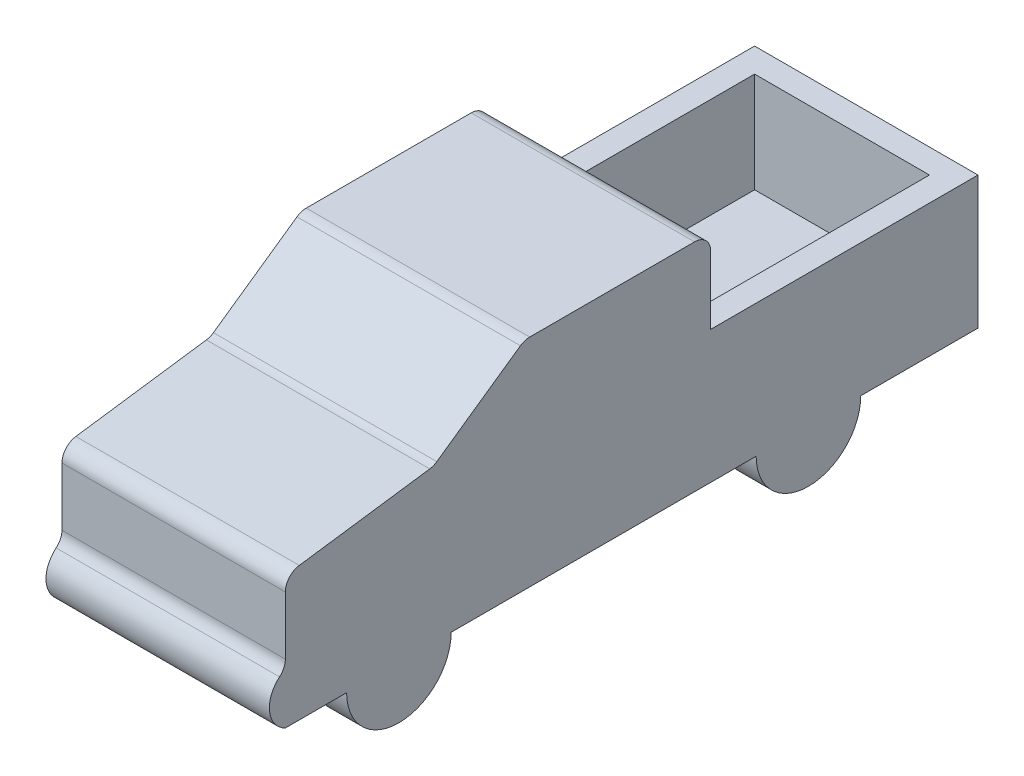
ISO-10303-21;
HEADER;
FILE_DESCRIPTION(('STEP AP214'),'2;1');
FILE_NAME('part.step','',(''),(''),'','','');
FILE_SCHEMA(('AUTOMOTIVE_DESIGN { 1 0 10303 214 1 1 1 1 }'));
ENDSEC;
DATA;
#1=APPLICATION_CONTEXT('core data for automotive mechanical design processes');
#2=APPLICATION_PROTOCOL_DEFINITION('international standard','automotive_design',2000,#1);
#3=PRODUCT_CONTEXT('',#1,'mechanical');
#4=PRODUCT('Part','Part','',(#3));
#5=PRODUCT_RELATED_PRODUCT_CATEGORY('part','',(#4));
#6=PRODUCT_DEFINITION_FORMATION('','',#4);
#7=PRODUCT_DEFINITION_CONTEXT('part definition',#1,'design');
#8=PRODUCT_DEFINITION('design','',#6,#7);
#9=PRODUCT_DEFINITION_SHAPE('','',#8);
#10=(LENGTH_UNIT() NAMED_UNIT(*) SI_UNIT(.MILLI.,.METRE.));
#11=(NAMED_UNIT(*) PLANE_ANGLE_UNIT() SI_UNIT($,.RADIAN.));
#12=(NAMED_UNIT(*) SI_UNIT($,.STERADIAN.) SOLID_ANGLE_UNIT());
#13=UNCERTAINTY_MEASURE_WITH_UNIT(LENGTH_MEASURE(1.E-05),#10,'distance_accuracy_value','');
#14=(GEOMETRIC_REPRESENTATION_CONTEXT(3) GLOBAL_UNCERTAINTY_ASSIGNED_CONTEXT((#13)) GLOBAL_UNIT_ASSIGNED_CONTEXT((#10,
#11,#12)) REPRESENTATION_CONTEXT('',''));
#15=CARTESIAN_POINT('',(0.,0.,0.));
#16=DIRECTION('',(0.,0.,1.));
#17=DIRECTION('',(1.,0.,0.));
#18=AXIS2_PLACEMENT_3D('',#15,#16,#17);
#19=CARTESIAN_POINT('',(69.,0.,0.));
#20=DIRECTION('',(0.,1.,0.));
#21=DIRECTION('',(0.,0.,1.));
#22=AXIS2_PLACEMENT_3D('',#19,#20,#21);
#23=PLANE('',#22);
#24=DIRECTION('',(-1.,0.,0.));
#25=VECTOR('',#24,1.);
#26=CARTESIAN_POINT('',(-48.6,0.,-92.6559396248703));
#27=LINE('',#26,#25);
#28=CARTESIAN_POINT('',(-48.6,0.,-92.6559396248703));
#29=VERTEX_POINT('',#28);
#30=CARTESIAN_POINT('',(-69.,0.,-92.6559396248703));
#31=VERTEX_POINT('',#30);
#32=EDGE_CURVE('E228',#29,#31,#27,.T.);
#33=ORIENTED_EDGE('',*,*,#32,.T.);
#34=DIRECTION('',(0.,0.,-1.));
#35=VECTOR('',#34,1.);
#36=CARTESIAN_POINT('',(-69.,0.,0.));
#37=LINE('',#36,#35);
#38=CARTESIAN_POINT('',(-69.,0.,-165.1));
#39=VERTEX_POINT('',#38);
#40=EDGE_CURVE('E211',#31,#39,#37,.T.);
#41=ORIENTED_EDGE('',*,*,#40,.T.);
#42=DIRECTION('',(-1.,0.,0.));
#43=VECTOR('',#42,1.);
#44=CARTESIAN_POINT('',(69.,0.,-165.1));
#45=LINE('',#44,#43);
#46=CARTESIAN_POINT('',(69.,0.,-165.1));
#47=VERTEX_POINT('',#46);
#48=EDGE_CURVE('E415',#47,#39,#45,.T.);
#49=ORIENTED_EDGE('',*,*,#48,.F.);
#50=DIRECTION('',(0.,0.,-1.));
#51=VECTOR('',#50,1.);
#52=CARTESIAN_POINT('',(69.,0.,262.79362659682));
#53=LINE('',#52,#51);
#54=CARTESIAN_POINT('',(69.,0.,-92.6559396248703));
#55=VERTEX_POINT('',#54);
#56=EDGE_CURVE('E343',#55,#47,#53,.T.);
#57=ORIENTED_EDGE('',*,*,#56,.F.);
#58=DIRECTION('',(1.,0.,0.));
#59=VECTOR('',#58,1.);
#60=CARTESIAN_POINT('',(48.6,0.,-92.6559396248703));
#61=LINE('',#60,#59);
#62=CARTESIAN_POINT('',(48.6,0.,-92.6559396248703));
#63=VERTEX_POINT('',#62);
#64=EDGE_CURVE('E277',#63,#55,#61,.T.);
#65=ORIENTED_EDGE('',*,*,#64,.F.);
#66=DIRECTION('',(0.,0.,1.));
#67=VECTOR('',#66,1.);
#68=CARTESIAN_POINT('',(48.6,0.,-28.0559396248703));
#69=LINE('',#68,#67);
#70=CARTESIAN_POINT('',(48.6,0.,-28.0559396248703));
#71=VERTEX_POINT('',#70);
#72=EDGE_CURVE('E273',#63,#71,#69,.T.);
#73=ORIENTED_EDGE('',*,*,#72,.T.);
#74=DIRECTION('',(1.,0.,0.));
#75=VECTOR('',#74,1.);
#76=CARTESIAN_POINT('',(48.6,0.,-28.0559396248703));
#77=LINE('',#76,#75);
#78=CARTESIAN_POINT('',(69.,0.,-28.0559396248703));
#79=VERTEX_POINT('',#78);
#80=EDGE_CURVE('E280',#71,#79,#77,.T.);
#81=ORIENTED_EDGE('',*,*,#80,.T.);
#82=CARTESIAN_POINT('',(69.,0.,160.34406037513));
#83=VERTEX_POINT('',#82);
#84=EDGE_CURVE('E350',#83,#79,#53,.T.);
#85=ORIENTED_EDGE('',*,*,#84,.F.);
#86=DIRECTION('',(1.,0.,0.));
#87=VECTOR('',#86,1.);
#88=CARTESIAN_POINT('',(48.6,0.,160.34406037513));
#89=LINE('',#88,#87);
#90=CARTESIAN_POINT('',(48.6,0.,160.34406037513));
#91=VERTEX_POINT('',#90);
#92=EDGE_CURVE('E295',#91,#83,#89,.T.);
#93=ORIENTED_EDGE('',*,*,#92,.F.);
#94=DIRECTION('',(0.,0.,1.));
#95=VECTOR('',#94,1.);
#96=CARTESIAN_POINT('',(48.6,0.,224.94406037513));
#97=LINE('',#96,#95);
#98=CARTESIAN_POINT('',(48.6,0.,224.94406037513));
#99=VERTEX_POINT('',#98);
#100=EDGE_CURVE('E291',#91,#99,#97,.T.);
#101=ORIENTED_EDGE('',*,*,#100,.T.);
#102=DIRECTION('',(1.,0.,0.));
#103=VECTOR('',#102,1.);
#104=CARTESIAN_POINT('',(48.6,0.,224.94406037513));
#105=LINE('',#104,#103);
#106=CARTESIAN_POINT('',(69.,0.,224.94406037513));
#107=VERTEX_POINT('',#106);
#108=EDGE_CURVE('E298',#99,#107,#105,.T.);
#109=ORIENTED_EDGE('',*,*,#108,.T.);
#110=CARTESIAN_POINT('',(69.,0.,262.79362659682));
#111=VERTEX_POINT('',#110);
#112=EDGE_CURVE('E345',#111,#107,#53,.T.);
#113=ORIENTED_EDGE('',*,*,#112,.F.);
#114=DIRECTION('',(-1.,0.,0.));
#115=VECTOR('',#114,1.);
#116=CARTESIAN_POINT('',(69.,0.,262.79362659682));
#117=LINE('',#116,#115);
#118=CARTESIAN_POINT('',(-69.,0.,262.79362659682));
#119=VERTEX_POINT('',#118);
#120=EDGE_CURVE('E418',#111,#119,#117,.T.);
#121=ORIENTED_EDGE('',*,*,#120,.T.);
#122=CARTESIAN_POINT('',(-69.,0.,224.94406037513));
#123=VERTEX_POINT('',#122);
#124=EDGE_CURVE('E226',#119,#123,#37,.T.);
#125=ORIENTED_EDGE('',*,*,#124,.T.);
#126=DIRECTION('',(-1.,0.,0.));
#127=VECTOR('',#126,1.);
#128=CARTESIAN_POINT('',(-48.6,0.,224.94406037513));
#129=LINE('',#128,#127);
#130=CARTESIAN_POINT('',(-48.6,0.,224.94406037513));
#131=VERTEX_POINT('',#130);
#132=EDGE_CURVE('E258',#131,#123,#129,.T.);
#133=ORIENTED_EDGE('',*,*,#132,.F.);
#134=DIRECTION('',(0.,0.,1.));
#135=VECTOR('',#134,1.);
#136=CARTESIAN_POINT('',(-48.6,0.,224.94406037513));
#137=LINE('',#136,#135);
#138=CARTESIAN_POINT('',(-48.6,0.,160.34406037513));
#139=VERTEX_POINT('',#138);
#140=EDGE_CURVE('E254',#139,#131,#137,.T.);
#141=ORIENTED_EDGE('',*,*,#140,.F.);
#142=DIRECTION('',(-1.,0.,0.));
#143=VECTOR('',#142,1.);
#144=CARTESIAN_POINT('',(-48.6,0.,160.34406037513));
#145=LINE('',#144,#143);
#146=CARTESIAN_POINT('',(-69.,0.,160.34406037513));
#147=VERTEX_POINT('',#146);
#148=EDGE_CURVE('E262',#139,#147,#145,.T.);
#149=ORIENTED_EDGE('',*,*,#148,.T.);
#150=CARTESIAN_POINT('',(-69.,0.,-28.0559396248702));
#151=VERTEX_POINT('',#150);
#152=EDGE_CURVE('E223',#147,#151,#37,.T.);
#153=ORIENTED_EDGE('',*,*,#152,.T.);
#154=DIRECTION('',(-1.,0.,0.));
#155=VECTOR('',#154,1.);
#156=CARTESIAN_POINT('',(-48.6,0.,-28.0559396248703));
#157=LINE('',#156,#155);
#158=CARTESIAN_POINT('',(-48.6,0.,-28.0559396248703));
#159=VERTEX_POINT('',#158);
#160=EDGE_CURVE('E236',#159,#151,#157,.T.);
#161=ORIENTED_EDGE('',*,*,#160,.F.);
#162=DIRECTION('',(0.,0.,1.));
#163=VECTOR('',#162,1.);
#164=CARTESIAN_POINT('',(-48.6,0.,-28.0559396248703));
#165=LINE('',#164,#163);
#166=EDGE_CURVE('E230',#29,#159,#165,.T.);
#167=ORIENTED_EDGE('',*,*,#166,.F.);
#168=EDGE_LOOP('',(#33,#41,#49,#57,#65,#73,#81,#85,#93,#101,#109,#113,#121,#125,#133,#141,#149,
#153,#161,#167));
#169=FACE_BOUND('',#168,.T.);
#170=ADVANCED_FACE('F37',(#169),#23,.F.);
#171=CARTESIAN_POINT('',(69.,81.9,-150.1));
#172=DIRECTION('',(0.,0.,-1.));
#173=DIRECTION('',(-1.,0.,0.));
#174=AXIS2_PLACEMENT_3D('',#171,#172,#173);
#175=PLANE('',#174);
#176=DIRECTION('',(-1.,0.,0.));
#177=VECTOR('',#176,1.);
#178=CARTESIAN_POINT('',(69.,81.9,-150.1));
#179=LINE('',#178,#177);
#180=CARTESIAN_POINT('',(54.,81.9,-150.1));
#181=VERTEX_POINT('',#180);
#182=CARTESIAN_POINT('',(-54.,81.9,-150.1));
#183=VERTEX_POINT('',#182);
#184=EDGE_CURVE('E408',#181,#183,#179,.T.);
#185=ORIENTED_EDGE('',*,*,#184,.T.);
#186=DIRECTION('',(0.,-1.,0.));
#187=VECTOR('',#186,1.);
#188=CARTESIAN_POINT('',(-54.,232.747638364013,-150.1));
#189=LINE('',#188,#187);
#190=CARTESIAN_POINT('',(-54.,20.,-150.1));
#191=VERTEX_POINT('',#190);
#192=EDGE_CURVE('E318',#183,#191,#189,.T.);
#193=ORIENTED_EDGE('',*,*,#192,.T.);
#194=DIRECTION('',(-1.,0.,0.));
#195=VECTOR('',#194,1.);
#196=CARTESIAN_POINT('',(69.,20.,-150.1));
#197=LINE('',#196,#195);
#198=CARTESIAN_POINT('',(54.,20.,-150.1));
#199=VERTEX_POINT('',#198);
#200=EDGE_CURVE('E404',#199,#191,#197,.T.);
#201=ORIENTED_EDGE('',*,*,#200,.F.);
#202=DIRECTION('',(0.,-1.,0.));
#203=VECTOR('',#202,1.);
#204=CARTESIAN_POINT('',(54.,232.747638364013,-150.1));
#205=LINE('',#204,#203);
#206=EDGE_CURVE('E334',#181,#199,#205,.T.);
#207=ORIENTED_EDGE('',*,*,#206,.F.);
#208=EDGE_LOOP('',(#185,#193,#201,#207));
#209=FACE_BOUND('',#208,.T.);
#210=ADVANCED_FACE('F558',(#209),#175,.F.);
#211=CARTESIAN_POINT('',(69.,20.,-150.1));
#212=DIRECTION('',(0.,-1.,0.));
#213=DIRECTION('',(0.,0.,-1.));
#214=AXIS2_PLACEMENT_3D('',#211,#212,#213);
#215=PLANE('',#214);
#216=ORIENTED_EDGE('',*,*,#200,.T.);
#217=DIRECTION('',(0.,0.,1.));
#218=VECTOR('',#217,1.);
#219=CARTESIAN_POINT('',(-54.,20.,0.));
#220=LINE('',#219,#218);
#221=CARTESIAN_POINT('',(-54.,20.,0.));
#222=VERTEX_POINT('',#221);
#223=EDGE_CURVE('E302',#191,#222,#220,.T.);
#224=ORIENTED_EDGE('',*,*,#223,.T.);
#225=DIRECTION('',(-1.,0.,0.));
#226=VECTOR('',#225,1.);
#227=CARTESIAN_POINT('',(69.,20.,0.));
#228=LINE('',#227,#226);
#229=CARTESIAN_POINT('',(54.,20.,0.));
#230=VERTEX_POINT('',#229);
#231=EDGE_CURVE('E374',#230,#222,#228,.T.);
#232=ORIENTED_EDGE('',*,*,#231,.F.);
#233=DIRECTION('',(0.,0.,1.));
#234=VECTOR('',#233,1.);
#235=CARTESIAN_POINT('',(54.,20.,0.));
#236=LINE('',#235,#234);
#237=EDGE_CURVE('E315',#199,#230,#236,.T.);
#238=ORIENTED_EDGE('',*,*,#237,.F.);
#239=EDGE_LOOP('',(#216,#224,#232,#238));
#240=FACE_BOUND('',#239,.T.);
#241=ADVANCED_FACE('F563',(#240),#215,.F.);
#242=CARTESIAN_POINT('',(69.,20.,0.));
#243=DIRECTION('',(0.,0.,1.));
#244=DIRECTION('',(1.,0.,0.));
#245=AXIS2_PLACEMENT_3D('',#242,#243,#244);
#246=PLANE('',#245);
#247=DIRECTION('',(0.,1.,0.));
#248=VECTOR('',#247,1.);
#249=CARTESIAN_POINT('',(-69.,20.,0.));
#250=LINE('',#249,#248);
#251=CARTESIAN_POINT('',(-69.,81.8999999999999,0.));
#252=VERTEX_POINT('',#251);
#253=CARTESIAN_POINT('',(-69.,123.7,0.));
#254=VERTEX_POINT('',#253);
#255=EDGE_CURVE('E383',#252,#254,#250,.T.);
#256=ORIENTED_EDGE('',*,*,#255,.T.);
#257=DIRECTION('',(-1.,0.,0.));
#258=VECTOR('',#257,1.);
#259=CARTESIAN_POINT('',(69.,123.7,0.));
#260=LINE('',#259,#258);
#261=CARTESIAN_POINT('',(69.,123.7,0.));
#262=VERTEX_POINT('',#261);
#263=EDGE_CURVE('E449',#254,#262,#260,.F.);
#264=ORIENTED_EDGE('',*,*,#263,.T.);
#265=DIRECTION('',(0.,1.,0.));
#266=VECTOR('',#265,1.);
#267=CARTESIAN_POINT('',(69.,20.,0.));
#268=LINE('',#267,#266);
#269=CARTESIAN_POINT('',(69.,81.8999999999998,0.));
#270=VERTEX_POINT('',#269);
#271=EDGE_CURVE('E356',#270,#262,#268,.T.);
#272=ORIENTED_EDGE('',*,*,#271,.F.);
#273=DIRECTION('',(-1.,0.,0.));
#274=VECTOR('',#273,1.);
#275=CARTESIAN_POINT('',(69.,81.8999999999998,0.));
#276=LINE('',#275,#274);
#277=CARTESIAN_POINT('',(54.,81.8999999999999,0.));
#278=VERTEX_POINT('',#277);
#279=EDGE_CURVE('E327',#270,#278,#276,.T.);
#280=ORIENTED_EDGE('',*,*,#279,.T.);
#281=DIRECTION('',(0.,-1.,0.));
#282=VECTOR('',#281,1.);
#283=CARTESIAN_POINT('',(54.,232.747638364013,0.));
#284=LINE('',#283,#282);
#285=EDGE_CURVE('E330',#278,#230,#284,.T.);
#286=ORIENTED_EDGE('',*,*,#285,.T.);
#287=ORIENTED_EDGE('',*,*,#231,.T.);
#288=DIRECTION('',(0.,-1.,0.));
#289=VECTOR('',#288,1.);
#290=CARTESIAN_POINT('',(-54.,232.747638364013,0.));
#291=LINE('',#290,#289);
#292=CARTESIAN_POINT('',(-54.,81.8999999999998,0.));
#293=VERTEX_POINT('',#292);
#294=EDGE_CURVE('E311',#293,#222,#291,.T.);
#295=ORIENTED_EDGE('',*,*,#294,.F.);
#296=DIRECTION('',(1.,0.,0.));
#297=VECTOR('',#296,1.);
#298=CARTESIAN_POINT('',(-69.,81.8999999999998,0.));
#299=LINE('',#298,#297);
#300=EDGE_CURVE('E310',#252,#293,#299,.T.);
#301=ORIENTED_EDGE('',*,*,#300,.F.);
#302=EDGE_LOOP('',(#256,#264,#272,#280,#286,#287,#295,#301));
#303=FACE_BOUND('',#302,.T.);
#304=ADVANCED_FACE('F571',(#303),#246,.F.);
#305=CARTESIAN_POINT('',(69.,15.7395723137565,255.14406037513));
#306=DIRECTION('',(-1.,0.,0.));
#307=DIRECTION('',(0.,0.,1.));
#308=AXIS2_PLACEMENT_3D('',#305,#306,#307);
#309=CYLINDRICAL_SURFACE('',#308,17.5);
#310=CARTESIAN_POINT('',(69.,15.7395723137565,255.14406037513));
#311=DIRECTION('',(1.,0.,0.));
#312=DIRECTION('',(0.,0.,-1.));
#313=AXIS2_PLACEMENT_3D('',#310,#311,#312);
#314=CIRCLE('',#313,17.5);
#315=CARTESIAN_POINT('',(69.,29.1597981364929,266.375602516206));
#316=VERTEX_POINT('',#315);
#317=EDGE_CURVE('E340',#316,#111,#314,.T.);
#318=ORIENTED_EDGE('',*,*,#317,.F.);
#319=DIRECTION('',(-1.,0.,0.));
#320=VECTOR('',#319,1.);
#321=CARTESIAN_POINT('',(69.,29.1597981364929,266.375602516206));
#322=LINE('',#321,#320);
#323=CARTESIAN_POINT('',(-69.,29.1597981364929,266.375602516206));
#324=VERTEX_POINT('',#323);
#325=EDGE_CURVE('E422',#316,#324,#322,.T.);
#326=ORIENTED_EDGE('',*,*,#325,.T.);
#327=CARTESIAN_POINT('',(-69.,15.7395723137565,255.14406037513));
#328=DIRECTION('',(1.,0.,0.));
#329=DIRECTION('',(0.,0.,-1.));
#330=AXIS2_PLACEMENT_3D('',#327,#328,#329);
#331=CIRCLE('',#330,17.5);
#332=EDGE_CURVE('E224',#324,#119,#331,.T.);
#333=ORIENTED_EDGE('',*,*,#332,.T.);
#334=ORIENTED_EDGE('',*,*,#120,.F.);
#335=EDGE_LOOP('',(#318,#326,#333,#334));
#336=FACE_BOUND('',#335,.T.);
#337=ADVANCED_FACE('F509',(#336),#309,.T.);
#338=CARTESIAN_POINT('',(69.,0.,-165.1));
#339=DIRECTION('',(0.,0.,1.));
#340=DIRECTION('',(1.,0.,0.));
#341=AXIS2_PLACEMENT_3D('',#338,#339,#340);
#342=PLANE('',#341);
#343=DIRECTION('',(0.,1.,0.));
#344=VECTOR('',#343,1.);
#345=CARTESIAN_POINT('',(-69.,0.,-165.1));
#346=LINE('',#345,#344);
#347=CARTESIAN_POINT('',(-69.,81.9,-165.1));
#348=VERTEX_POINT('',#347);
#349=EDGE_CURVE('E218',#39,#348,#346,.T.);
#350=ORIENTED_EDGE('',*,*,#349,.T.);
#351=DIRECTION('',(-1.,0.,0.));
#352=VECTOR('',#351,1.);
#353=CARTESIAN_POINT('',(69.,81.9,-165.1));
#354=LINE('',#353,#352);
#355=CARTESIAN_POINT('',(69.,81.9,-165.1));
#356=VERTEX_POINT('',#355);
#357=EDGE_CURVE('E411',#356,#348,#354,.T.);
#358=ORIENTED_EDGE('',*,*,#357,.F.);
#359=DIRECTION('',(0.,1.,0.));
#360=VECTOR('',#359,1.);
#361=CARTESIAN_POINT('',(69.,0.,-165.1));
#362=LINE('',#361,#360);
#363=EDGE_CURVE('E349',#47,#356,#362,.T.);
#364=ORIENTED_EDGE('',*,*,#363,.F.);
#365=ORIENTED_EDGE('',*,*,#48,.T.);
#366=EDGE_LOOP('',(#350,#358,#364,#365));
#367=FACE_BOUND('',#366,.T.);
#368=ADVANCED_FACE('F530',(#367),#342,.F.);
#369=CARTESIAN_POINT('',(69.,81.9,-165.1));
#370=DIRECTION('',(0.,-1.,0.));
#371=DIRECTION('',(0.,0.,-1.));
#372=AXIS2_PLACEMENT_3D('',#369,#370,#371);
#373=PLANE('',#372);
#374=DIRECTION('',(0.,0.,1.));
#375=VECTOR('',#374,1.);
#376=CARTESIAN_POINT('',(-69.,81.9,-165.1));
#377=LINE('',#376,#375);
#378=EDGE_CURVE('E380',#348,#252,#377,.T.);
#379=ORIENTED_EDGE('',*,*,#378,.T.);
#380=ORIENTED_EDGE('',*,*,#300,.T.);
#381=DIRECTION('',(0.,0.,-1.));
#382=VECTOR('',#381,1.);
#383=CARTESIAN_POINT('',(-54.,81.8999999999998,-1.1346331053111E-13));
#384=LINE('',#383,#382);
#385=EDGE_CURVE('E306',#293,#183,#384,.T.);
#386=ORIENTED_EDGE('',*,*,#385,.T.);
#387=ORIENTED_EDGE('',*,*,#184,.F.);
#388=DIRECTION('',(0.,0.,-1.));
#389=VECTOR('',#388,1.);
#390=CARTESIAN_POINT('',(54.,81.8999999999998,-1.1346331053111E-13));
#391=LINE('',#390,#389);
#392=EDGE_CURVE('E324',#278,#181,#391,.T.);
#393=ORIENTED_EDGE('',*,*,#392,.F.);
#394=ORIENTED_EDGE('',*,*,#279,.F.);
#395=DIRECTION('',(0.,0.,1.));
#396=VECTOR('',#395,1.);
#397=CARTESIAN_POINT('',(69.,81.9,-165.1));
#398=LINE('',#397,#396);
#399=EDGE_CURVE('E353',#356,#270,#398,.T.);
#400=ORIENTED_EDGE('',*,*,#399,.F.);
#401=ORIENTED_EDGE('',*,*,#357,.T.);
#402=EDGE_LOOP('',(#379,#380,#386,#387,#393,#394,#400,#401));
#403=FACE_BOUND('',#402,.T.);
#404=ADVANCED_FACE('F534',(#403),#373,.F.);
#405=CARTESIAN_POINT('',(69.,133.7,0.));
#406=DIRECTION('',(0.,-1.,0.));
#407=DIRECTION('',(0.,0.,-1.));
#408=AXIS2_PLACEMENT_3D('',#405,#406,#407);
#409=PLANE('',#408);
#410=DIRECTION('',(0.,0.,1.));
#411=VECTOR('',#410,1.);
#412=CARTESIAN_POINT('',(69.,133.7,0.));
#413=LINE('',#412,#411);
#414=CARTESIAN_POINT('',(69.,133.7,10.));
#415=VERTEX_POINT('',#414);
#416=CARTESIAN_POINT('',(69.,133.7,111.84701211121));
#417=VERTEX_POINT('',#416);
#418=EDGE_CURVE('E360',#415,#417,#413,.T.);
#419=ORIENTED_EDGE('',*,*,#418,.F.);
#420=DIRECTION('',(-1.,0.,0.));
#421=VECTOR('',#420,1.);
#422=CARTESIAN_POINT('',(69.,133.7,10.));
#423=LINE('',#422,#421);
#424=CARTESIAN_POINT('',(-69.,133.7,10.));
#425=VERTEX_POINT('',#424);
#426=EDGE_CURVE('E436',#415,#425,#423,.T.);
#427=ORIENTED_EDGE('',*,*,#426,.T.);
#428=DIRECTION('',(0.,0.,1.));
#429=VECTOR('',#428,1.);
#430=CARTESIAN_POINT('',(-69.,133.7,0.));
#431=LINE('',#430,#429);
#432=CARTESIAN_POINT('',(-69.,133.7,111.84701211121));
#433=VERTEX_POINT('',#432);
#434=EDGE_CURVE('E387',#425,#433,#431,.T.);
#435=ORIENTED_EDGE('',*,*,#434,.T.);
#436=DIRECTION('',(-1.,0.,0.));
#437=VECTOR('',#436,1.);
#438=CARTESIAN_POINT('',(69.,133.7,111.84701211121));
#439=LINE('',#438,#437);
#440=EDGE_CURVE('E433',#433,#417,#439,.F.);
#441=ORIENTED_EDGE('',*,*,#440,.T.);
#442=EDGE_LOOP('',(#419,#427,#435,#441));
#443=FACE_BOUND('',#442,.T.);
#444=ADVANCED_FACE('F544',(#443),#409,.F.);
#445=CARTESIAN_POINT('',(69.,133.7,115.));
#446=DIRECTION('',(0.,-0.819152044288995,-0.573576436351042));
#447=DIRECTION('',(0.,0.573576436351042,-0.819152044288995));
#448=AXIS2_PLACEMENT_3D('',#445,#446,#447);
#449=PLANE('',#448);
#450=DIRECTION('',(0.,-0.573576436351042,0.819152044288994));
#451=VECTOR('',#450,1.);
#452=CARTESIAN_POINT('',(69.,133.7,115.));
#453=LINE('',#452,#451);
#454=CARTESIAN_POINT('',(69.,131.89152044289,117.582776474721));
#455=VERTEX_POINT('',#454);
#456=CARTESIAN_POINT('',(69.,95.7296916570861,169.227220175317));
#457=VERTEX_POINT('',#456);
#458=EDGE_CURVE('E364',#455,#457,#453,.T.);
#459=ORIENTED_EDGE('',*,*,#458,.F.);
#460=DIRECTION('',(-1.,0.,0.));
#461=VECTOR('',#460,1.);
#462=CARTESIAN_POINT('',(69.,131.89152044289,117.582776474721));
#463=LINE('',#462,#461);
#464=CARTESIAN_POINT('',(-69.,131.89152044289,117.582776474721));
#465=VERTEX_POINT('',#464);
#466=EDGE_CURVE('E464',#455,#465,#463,.T.);
#467=ORIENTED_EDGE('',*,*,#466,.T.);
#468=DIRECTION('',(0.,-0.573576436351042,0.819152044288994));
#469=VECTOR('',#468,1.);
#470=CARTESIAN_POINT('',(-69.,133.7,115.));
#471=LINE('',#470,#469);
#472=CARTESIAN_POINT('',(-69.,95.7296916570861,169.227220175317));
#473=VERTEX_POINT('',#472);
#474=EDGE_CURVE('E391',#465,#473,#471,.T.);
#475=ORIENTED_EDGE('',*,*,#474,.T.);
#476=DIRECTION('',(-1.,0.,0.));
#477=VECTOR('',#476,1.);
#478=CARTESIAN_POINT('',(69.,95.7296916570861,169.227220175317));
#479=LINE('',#478,#477);
#480=EDGE_CURVE('E461',#473,#457,#479,.F.);
#481=ORIENTED_EDGE('',*,*,#480,.T.);
#482=EDGE_LOOP('',(#459,#467,#475,#481));
#483=FACE_BOUND('',#482,.T.);
#484=ADVANCED_FACE('F488',(#483),#449,.F.);
#485=CARTESIAN_POINT('',(69.,94.3526564663185,171.193830238225));
#486=DIRECTION('',(0.,-0.990268068741571,-0.139173100960059));
#487=DIRECTION('',(0.,0.139173100960059,-0.990268068741571));
#488=AXIS2_PLACEMENT_3D('',#485,#486,#487);
#489=PLANE('',#488);
#490=DIRECTION('',(0.,-0.139173100960059,0.990268068741571));
#491=VECTOR('',#490,1.);
#492=CARTESIAN_POINT('',(69.,94.3526564663185,171.193830238225));
#493=LINE('',#492,#491);
#494=CARTESIAN_POINT('',(69.,94.0185314125603,173.571253529226));
#495=VERTEX_POINT('',#494);
#496=CARTESIAN_POINT('',(69.,82.6889579367665,254.185357606421));
#497=VERTEX_POINT('',#496);
#498=EDGE_CURVE('E367',#495,#497,#493,.T.);
#499=ORIENTED_EDGE('',*,*,#498,.F.);
#500=DIRECTION('',(-1.,0.,0.));
#501=VECTOR('',#500,1.);
#502=CARTESIAN_POINT('',(-69.,94.0185314125603,173.571253529226));
#503=LINE('',#502,#501);
#504=CARTESIAN_POINT('',(-69.,94.0185314125603,173.571253529226));
#505=VERTEX_POINT('',#504);
#506=EDGE_CURVE('E470',#495,#505,#503,.T.);
#507=ORIENTED_EDGE('',*,*,#506,.T.);
#508=DIRECTION('',(0.,-0.139173100960059,0.990268068741571));
#509=VECTOR('',#508,1.);
#510=CARTESIAN_POINT('',(-69.,94.3526564663185,171.193830238225));
#511=LINE('',#510,#509);
#512=CARTESIAN_POINT('',(-69.,82.6889579367665,254.185357606421));
#513=VERTEX_POINT('',#512);
#514=EDGE_CURVE('E395',#505,#513,#511,.T.);
#515=ORIENTED_EDGE('',*,*,#514,.T.);
#516=DIRECTION('',(-1.,0.,0.));
#517=VECTOR('',#516,1.);
#518=CARTESIAN_POINT('',(69.,82.6889579367665,254.185357606421));
#519=LINE('',#518,#517);
#520=EDGE_CURVE('E53',#513,#497,#519,.F.);
#521=ORIENTED_EDGE('',*,*,#520,.T.);
#522=EDGE_LOOP('',(#499,#507,#515,#521));
#523=FACE_BOUND('',#522,.T.);
#524=ADVANCED_FACE('F491',(#523),#489,.F.);
#525=CARTESIAN_POINT('',(69.,81.4791446275131,262.79362659682));
#526=DIRECTION('',(0.,0.,-1.));
#527=DIRECTION('',(0.,1.,0.));
#528=AXIS2_PLACEMENT_3D('',#525,#526,#527);
#529=PLANE('',#528);
#530=DIRECTION('',(0.,-1.,0.));
#531=VECTOR('',#530,1.);
#532=CARTESIAN_POINT('',(-69.,81.4791446275131,262.79362659682));
#533=LINE('',#532,#531);
#534=CARTESIAN_POINT('',(-69.,72.7862772493507,262.79362659682));
#535=VERTEX_POINT('',#534);
#536=CARTESIAN_POINT('',(-69.,36.8284986066279,262.79362659682));
#537=VERTEX_POINT('',#536);
#538=EDGE_CURVE('E344',#535,#537,#533,.T.);
#539=ORIENTED_EDGE('',*,*,#538,.T.);
#540=DIRECTION('',(1.,0.,0.));
#541=VECTOR('',#540,1.);
#542=CARTESIAN_POINT('',(69.,36.8284986066279,262.79362659682));
#543=LINE('',#542,#541);
#544=CARTESIAN_POINT('',(69.,36.8284986066279,262.79362659682));
#545=VERTEX_POINT('',#544);
#546=EDGE_CURVE('E430',#537,#545,#543,.T.);
#547=ORIENTED_EDGE('',*,*,#546,.T.);
#548=DIRECTION('',(0.,-1.,0.));
#549=VECTOR('',#548,1.);
#550=CARTESIAN_POINT('',(69.,81.4791446275131,262.79362659682));
#551=LINE('',#550,#549);
#552=CARTESIAN_POINT('',(69.,72.7862772493507,262.79362659682));
#553=VERTEX_POINT('',#552);
#554=EDGE_CURVE('E370',#553,#545,#551,.T.);
#555=ORIENTED_EDGE('',*,*,#554,.F.);
#556=DIRECTION('',(-1.,0.,0.));
#557=VECTOR('',#556,1.);
#558=CARTESIAN_POINT('',(69.,72.7862772493507,262.79362659682));
#559=LINE('',#558,#557);
#560=EDGE_CURVE('E426',#553,#535,#559,.T.);
#561=ORIENTED_EDGE('',*,*,#560,.T.);
#562=EDGE_LOOP('',(#539,#547,#555,#561));
#563=FACE_BOUND('',#562,.T.);
#564=ADVANCED_FACE('F499',(#563),#529,.F.);
#565=CARTESIAN_POINT('',(69.,15.7395723137565,255.14406037513));
#566=DIRECTION('',(1.,0.,0.));
#567=DIRECTION('',(0.,0.,-1.));
#568=AXIS2_PLACEMENT_3D('',#565,#566,#567);
#569=PLANE('',#568);
#570=ORIENTED_EDGE('',*,*,#271,.T.);
#571=CARTESIAN_POINT('',(69.,123.7,10.));
#572=DIRECTION('',(1.,0.,0.));
#573=DIRECTION('',(0.,0.,-1.));
#574=AXIS2_PLACEMENT_3D('',#571,#572,#573);
#575=CIRCLE('',#574,10.);
#576=EDGE_CURVE('E458',#262,#415,#575,.T.);
#577=ORIENTED_EDGE('',*,*,#576,.T.);
#578=ORIENTED_EDGE('',*,*,#418,.T.);
#579=CARTESIAN_POINT('',(69.,123.7,111.84701211121));
#580=DIRECTION('',(1.,0.,0.));
#581=DIRECTION('',(0.,0.,-1.));
#582=AXIS2_PLACEMENT_3D('',#579,#580,#581);
#583=CIRCLE('',#582,10.);
#584=EDGE_CURVE('E455',#417,#455,#583,.T.);
#585=ORIENTED_EDGE('',*,*,#584,.T.);
#586=ORIENTED_EDGE('',*,*,#458,.T.);
#587=CARTESIAN_POINT('',(69.,103.921212099976,174.962984538827));
#588=DIRECTION('',(1.,0.,0.));
#589=DIRECTION('',(0.,0.,-1.));
#590=AXIS2_PLACEMENT_3D('',#587,#588,#589);
#591=CIRCLE('',#590,10.);
#592=EDGE_CURVE('E11',#457,#495,#591,.F.);
#593=ORIENTED_EDGE('',*,*,#592,.T.);
#594=ORIENTED_EDGE('',*,*,#498,.T.);
#595=CARTESIAN_POINT('',(69.,72.7862772493507,252.79362659682));
#596=DIRECTION('',(1.,0.,0.));
#597=DIRECTION('',(0.,0.,-1.));
#598=AXIS2_PLACEMENT_3D('',#595,#596,#597);
#599=CIRCLE('',#598,10.);
#600=EDGE_CURVE('E452',#497,#553,#599,.T.);
#601=ORIENTED_EDGE('',*,*,#600,.T.);
#602=ORIENTED_EDGE('',*,*,#554,.T.);
#603=CARTESIAN_POINT('',(69.,36.8284986066279,272.79362659682));
#604=DIRECTION('',(1.,0.,0.));
#605=DIRECTION('',(0.,0.,-1.));
#606=AXIS2_PLACEMENT_3D('',#603,#604,#605);
#607=CIRCLE('',#606,10.);
#608=EDGE_CURVE('E477',#545,#316,#607,.F.);
#609=ORIENTED_EDGE('',*,*,#608,.T.);
#610=ORIENTED_EDGE('',*,*,#317,.T.);
#611=ORIENTED_EDGE('',*,*,#112,.T.);
#612=CARTESIAN_POINT('',(69.,0.,192.64406037513));
#613=DIRECTION('',(1.,0.,0.));
#614=DIRECTION('',(0.,0.,-1.));
#615=AXIS2_PLACEMENT_3D('',#612,#613,#614);
#616=CIRCLE('',#615,32.3);
#617=EDGE_CURVE('E284',#107,#83,#616,.T.);
#618=ORIENTED_EDGE('',*,*,#617,.T.);
#619=ORIENTED_EDGE('',*,*,#84,.T.);
#620=CARTESIAN_POINT('',(69.,0.,-60.3559396248703));
#621=DIRECTION('',(1.,0.,0.));
#622=DIRECTION('',(0.,0.,-1.));
#623=AXIS2_PLACEMENT_3D('',#620,#621,#622);
#624=CIRCLE('',#623,32.3);
#625=EDGE_CURVE('E266',#79,#55,#624,.T.);
#626=ORIENTED_EDGE('',*,*,#625,.T.);
#627=ORIENTED_EDGE('',*,*,#56,.T.);
#628=ORIENTED_EDGE('',*,*,#363,.T.);
#629=ORIENTED_EDGE('',*,*,#399,.T.);
#630=EDGE_LOOP('',(#570,#577,#578,#585,#586,#593,#594,#601,#602,#609,#610,#611,#618,#619,#626,
#627,#628,#629));
#631=FACE_BOUND('',#630,.T.);
#632=ADVANCED_FACE('F493',(#631),#569,.T.);
#633=CARTESIAN_POINT('',(-69.,15.7395723137565,255.14406037513));
#634=DIRECTION('',(1.,0.,0.));
#635=DIRECTION('',(0.,0.,-1.));
#636=AXIS2_PLACEMENT_3D('',#633,#634,#635);
#637=PLANE('',#636);
#638=ORIENTED_EDGE('',*,*,#434,.F.);
#639=CARTESIAN_POINT('',(-69.,123.7,10.));
#640=DIRECTION('',(1.,0.,0.));
#641=DIRECTION('',(0.,0.,-1.));
#642=AXIS2_PLACEMENT_3D('',#639,#640,#641);
#643=CIRCLE('',#642,10.);
#644=EDGE_CURVE('E446',#425,#254,#643,.F.);
#645=ORIENTED_EDGE('',*,*,#644,.T.);
#646=ORIENTED_EDGE('',*,*,#255,.F.);
#647=ORIENTED_EDGE('',*,*,#378,.F.);
#648=ORIENTED_EDGE('',*,*,#349,.F.);
#649=ORIENTED_EDGE('',*,*,#40,.F.);
#650=CARTESIAN_POINT('',(-69.,0.,-60.3559396248703));
#651=DIRECTION('',(1.,0.,0.));
#652=DIRECTION('',(0.,0.,-1.));
#653=AXIS2_PLACEMENT_3D('',#650,#651,#652);
#654=CIRCLE('',#653,32.3);
#655=EDGE_CURVE('E216',#151,#31,#654,.T.);
#656=ORIENTED_EDGE('',*,*,#655,.F.);
#657=ORIENTED_EDGE('',*,*,#152,.F.);
#658=CARTESIAN_POINT('',(-69.,0.,192.64406037513));
#659=DIRECTION('',(1.,0.,0.));
#660=DIRECTION('',(0.,0.,-1.));
#661=AXIS2_PLACEMENT_3D('',#658,#659,#660);
#662=CIRCLE('',#661,32.3);
#663=EDGE_CURVE('E235',#123,#147,#662,.T.);
#664=ORIENTED_EDGE('',*,*,#663,.F.);
#665=ORIENTED_EDGE('',*,*,#124,.F.);
#666=ORIENTED_EDGE('',*,*,#332,.F.);
#667=CARTESIAN_POINT('',(-69.,36.8284986066279,272.79362659682));
#668=DIRECTION('',(1.,0.,0.));
#669=DIRECTION('',(0.,0.,-1.));
#670=AXIS2_PLACEMENT_3D('',#667,#668,#669);
#671=CIRCLE('',#670,10.);
#672=EDGE_CURVE('E474',#324,#537,#671,.T.);
#673=ORIENTED_EDGE('',*,*,#672,.T.);
#674=ORIENTED_EDGE('',*,*,#538,.F.);
#675=CARTESIAN_POINT('',(-69.,72.7862772493507,252.79362659682));
#676=DIRECTION('',(1.,0.,0.));
#677=DIRECTION('',(0.,0.,-1.));
#678=AXIS2_PLACEMENT_3D('',#675,#676,#677);
#679=CIRCLE('',#678,10.);
#680=EDGE_CURVE('E440',#535,#513,#679,.F.);
#681=ORIENTED_EDGE('',*,*,#680,.T.);
#682=ORIENTED_EDGE('',*,*,#514,.F.);
#683=CARTESIAN_POINT('',(-69.,103.921212099976,174.962984538827));
#684=DIRECTION('',(1.,0.,0.));
#685=DIRECTION('',(0.,0.,-1.));
#686=AXIS2_PLACEMENT_3D('',#683,#684,#685);
#687=CIRCLE('',#686,10.);
#688=EDGE_CURVE('E46',#505,#473,#687,.T.);
#689=ORIENTED_EDGE('',*,*,#688,.T.);
#690=ORIENTED_EDGE('',*,*,#474,.F.);
#691=CARTESIAN_POINT('',(-69.,123.7,111.84701211121));
#692=DIRECTION('',(1.,0.,0.));
#693=DIRECTION('',(0.,0.,-1.));
#694=AXIS2_PLACEMENT_3D('',#691,#692,#693);
#695=CIRCLE('',#694,10.);
#696=EDGE_CURVE('E443',#465,#433,#695,.F.);
#697=ORIENTED_EDGE('',*,*,#696,.T.);
#698=EDGE_LOOP('',(#638,#645,#646,#647,#648,#649,#656,#657,#664,#665,#666,#673,#674,#681,#682,
#689,#690,#697));
#699=FACE_BOUND('',#698,.T.);
#700=ADVANCED_FACE('F214',(#699),#637,.F.);
#701=CARTESIAN_POINT('',(54.,232.747638364013,0.));
#702=DIRECTION('',(1.,0.,0.));
#703=DIRECTION('',(0.,0.,-1.));
#704=AXIS2_PLACEMENT_3D('',#701,#702,#703);
#705=PLANE('',#704);
#706=ORIENTED_EDGE('',*,*,#285,.F.);
#707=ORIENTED_EDGE('',*,*,#392,.T.);
#708=ORIENTED_EDGE('',*,*,#206,.T.);
#709=ORIENTED_EDGE('',*,*,#237,.T.);
#710=EDGE_LOOP('',(#706,#707,#708,#709));
#711=FACE_BOUND('',#710,.T.);
#712=ADVANCED_FACE('F607',(#711),#705,.F.);
#713=CARTESIAN_POINT('',(-54.,232.747638364013,0.));
#714=DIRECTION('',(1.,0.,0.));
#715=DIRECTION('',(0.,0.,-1.));
#716=AXIS2_PLACEMENT_3D('',#713,#714,#715);
#717=PLANE('',#716);
#718=ORIENTED_EDGE('',*,*,#385,.F.);
#719=ORIENTED_EDGE('',*,*,#294,.T.);
#720=ORIENTED_EDGE('',*,*,#223,.F.);
#721=ORIENTED_EDGE('',*,*,#192,.F.);
#722=EDGE_LOOP('',(#718,#719,#720,#721));
#723=FACE_BOUND('',#722,.T.);
#724=ADVANCED_FACE('F604',(#723),#717,.T.);
#725=CARTESIAN_POINT('',(48.6,0.,192.64406037513));
#726=DIRECTION('',(1.,0.,0.));
#727=DIRECTION('',(0.,0.,-1.));
#728=AXIS2_PLACEMENT_3D('',#725,#726,#727);
#729=CYLINDRICAL_SURFACE('',#728,32.3);
#730=ORIENTED_EDGE('',*,*,#617,.F.);
#731=ORIENTED_EDGE('',*,*,#108,.F.);
#732=CARTESIAN_POINT('',(48.6,0.,192.64406037513));
#733=DIRECTION('',(1.,0.,0.));
#734=DIRECTION('',(0.,0.,-1.));
#735=AXIS2_PLACEMENT_3D('',#732,#733,#734);
#736=CIRCLE('',#735,32.3);
#737=EDGE_CURVE('E288',#99,#91,#736,.T.);
#738=ORIENTED_EDGE('',*,*,#737,.T.);
#739=ORIENTED_EDGE('',*,*,#92,.T.);
#740=EDGE_LOOP('',(#730,#731,#738,#739));
#741=FACE_BOUND('',#740,.T.);
#742=ADVANCED_FACE('F516',(#741),#729,.T.);
#743=CARTESIAN_POINT('',(48.6,0.,192.64406037513));
#744=DIRECTION('',(1.,0.,0.));
#745=DIRECTION('',(0.,0.,-1.));
#746=AXIS2_PLACEMENT_3D('',#743,#744,#745);
#747=PLANE('',#746);
#748=ORIENTED_EDGE('',*,*,#737,.F.);
#749=ORIENTED_EDGE('',*,*,#100,.F.);
#750=EDGE_LOOP('',(#748,#749));
#751=FACE_BOUND('',#750,.T.);
#752=ADVANCED_FACE('F518',(#751),#747,.F.);
#753=CARTESIAN_POINT('',(48.6,0.,-60.3559396248703));
#754=DIRECTION('',(1.,0.,0.));
#755=DIRECTION('',(0.,0.,-1.));
#756=AXIS2_PLACEMENT_3D('',#753,#754,#755);
#757=CYLINDRICAL_SURFACE('',#756,32.3);
#758=ORIENTED_EDGE('',*,*,#625,.F.);
#759=ORIENTED_EDGE('',*,*,#80,.F.);
#760=CARTESIAN_POINT('',(48.6,0.,-60.3559396248703));
#761=DIRECTION('',(1.,0.,0.));
#762=DIRECTION('',(0.,0.,-1.));
#763=AXIS2_PLACEMENT_3D('',#760,#761,#762);
#764=CIRCLE('',#763,32.3);
#765=EDGE_CURVE('E270',#71,#63,#764,.T.);
#766=ORIENTED_EDGE('',*,*,#765,.T.);
#767=ORIENTED_EDGE('',*,*,#64,.T.);
#768=EDGE_LOOP('',(#758,#759,#766,#767));
#769=FACE_BOUND('',#768,.T.);
#770=ADVANCED_FACE('F595',(#769),#757,.T.);
#771=CARTESIAN_POINT('',(48.6,0.,-60.3559396248703));
#772=DIRECTION('',(1.,0.,0.));
#773=DIRECTION('',(0.,0.,-1.));
#774=AXIS2_PLACEMENT_3D('',#771,#772,#773);
#775=PLANE('',#774);
#776=ORIENTED_EDGE('',*,*,#765,.F.);
#777=ORIENTED_EDGE('',*,*,#72,.F.);
#778=EDGE_LOOP('',(#776,#777));
#779=FACE_BOUND('',#778,.T.);
#780=ADVANCED_FACE('F591',(#779),#775,.F.);
#781=CARTESIAN_POINT('',(-48.6,0.,192.64406037513));
#782=DIRECTION('',(-1.,0.,0.));
#783=DIRECTION('',(0.,0.,1.));
#784=AXIS2_PLACEMENT_3D('',#781,#782,#783);
#785=CYLINDRICAL_SURFACE('',#784,32.3);
#786=ORIENTED_EDGE('',*,*,#663,.T.);
#787=ORIENTED_EDGE('',*,*,#148,.F.);
#788=CARTESIAN_POINT('',(-48.6,0.,192.64406037513));
#789=DIRECTION('',(1.,0.,0.));
#790=DIRECTION('',(0.,0.,-1.));
#791=AXIS2_PLACEMENT_3D('',#788,#789,#790);
#792=CIRCLE('',#791,32.3);
#793=EDGE_CURVE('E250',#131,#139,#792,.T.);
#794=ORIENTED_EDGE('',*,*,#793,.F.);
#795=ORIENTED_EDGE('',*,*,#132,.T.);
#796=EDGE_LOOP('',(#786,#787,#794,#795));
#797=FACE_BOUND('',#796,.T.);
#798=ADVANCED_FACE('F587',(#797),#785,.T.);
#799=CARTESIAN_POINT('',(-48.6,0.,192.64406037513));
#800=DIRECTION('',(-1.,0.,0.));
#801=DIRECTION('',(0.,0.,-1.));
#802=AXIS2_PLACEMENT_3D('',#799,#800,#801);
#803=PLANE('',#802);
#804=ORIENTED_EDGE('',*,*,#793,.T.);
#805=ORIENTED_EDGE('',*,*,#140,.T.);
#806=EDGE_LOOP('',(#804,#805));
#807=FACE_BOUND('',#806,.T.);
#808=ADVANCED_FACE('F582',(#807),#803,.F.);
#809=CARTESIAN_POINT('',(-48.6,0.,-60.3559396248703));
#810=DIRECTION('',(-1.,0.,0.));
#811=DIRECTION('',(0.,0.,1.));
#812=AXIS2_PLACEMENT_3D('',#809,#810,#811);
#813=CYLINDRICAL_SURFACE('',#812,32.3);
#814=ORIENTED_EDGE('',*,*,#655,.T.);
#815=ORIENTED_EDGE('',*,*,#32,.F.);
#816=CARTESIAN_POINT('',(-48.6,0.,-60.3559396248703));
#817=DIRECTION('',(1.,0.,0.));
#818=DIRECTION('',(0.,0.,-1.));
#819=AXIS2_PLACEMENT_3D('',#816,#817,#818);
#820=CIRCLE('',#819,32.3);
#821=EDGE_CURVE('E241',#159,#29,#820,.T.);
#822=ORIENTED_EDGE('',*,*,#821,.F.);
#823=ORIENTED_EDGE('',*,*,#160,.T.);
#824=EDGE_LOOP('',(#814,#815,#822,#823));
#825=FACE_BOUND('',#824,.T.);
#826=ADVANCED_FACE('F239',(#825),#813,.T.);
#827=CARTESIAN_POINT('',(-48.6,0.,-60.3559396248703));
#828=DIRECTION('',(-1.,0.,0.));
#829=DIRECTION('',(0.,0.,-1.));
#830=AXIS2_PLACEMENT_3D('',#827,#828,#829);
#831=PLANE('',#830);
#832=ORIENTED_EDGE('',*,*,#821,.T.);
#833=ORIENTED_EDGE('',*,*,#166,.T.);
#834=EDGE_LOOP('',(#832,#833));
#835=FACE_BOUND('',#834,.T.);
#836=ADVANCED_FACE('F573',(#835),#831,.F.);
#837=CARTESIAN_POINT('',(69.,36.8284986066279,272.79362659682));
#838=DIRECTION('',(-1.,0.,0.));
#839=DIRECTION('',(0.,0.,1.));
#840=AXIS2_PLACEMENT_3D('',#837,#838,#839);
#841=CYLINDRICAL_SURFACE('',#840,10.);
#842=ORIENTED_EDGE('',*,*,#608,.F.);
#843=ORIENTED_EDGE('',*,*,#546,.F.);
#844=ORIENTED_EDGE('',*,*,#672,.F.);
#845=ORIENTED_EDGE('',*,*,#325,.F.);
#846=EDGE_LOOP('',(#842,#843,#844,#845));
#847=FACE_BOUND('',#846,.T.);
#848=ADVANCED_FACE('F506',(#847),#841,.F.);
#849=CARTESIAN_POINT('',(69.,123.7,10.));
#850=DIRECTION('',(-1.,0.,0.));
#851=DIRECTION('',(0.,0.,1.));
#852=AXIS2_PLACEMENT_3D('',#849,#850,#851);
#853=CYLINDRICAL_SURFACE('',#852,10.);
#854=ORIENTED_EDGE('',*,*,#576,.F.);
#855=ORIENTED_EDGE('',*,*,#263,.F.);
#856=ORIENTED_EDGE('',*,*,#644,.F.);
#857=ORIENTED_EDGE('',*,*,#426,.F.);
#858=EDGE_LOOP('',(#854,#855,#856,#857));
#859=FACE_BOUND('',#858,.T.);
#860=ADVANCED_FACE('F542',(#859),#853,.T.);
#861=CARTESIAN_POINT('',(69.,123.7,111.84701211121));
#862=DIRECTION('',(-1.,0.,0.));
#863=DIRECTION('',(0.,0.,1.));
#864=AXIS2_PLACEMENT_3D('',#861,#862,#863);
#865=CYLINDRICAL_SURFACE('',#864,10.);
#866=ORIENTED_EDGE('',*,*,#584,.F.);
#867=ORIENTED_EDGE('',*,*,#440,.F.);
#868=ORIENTED_EDGE('',*,*,#696,.F.);
#869=ORIENTED_EDGE('',*,*,#466,.F.);
#870=EDGE_LOOP('',(#866,#867,#868,#869));
#871=FACE_BOUND('',#870,.T.);
#872=ADVANCED_FACE('F549',(#871),#865,.T.);
#873=CARTESIAN_POINT('',(69.,103.921212099976,174.962984538827));
#874=DIRECTION('',(1.,0.,0.));
#875=DIRECTION('',(0.,0.,-1.));
#876=AXIS2_PLACEMENT_3D('',#873,#874,#875);
#877=CYLINDRICAL_SURFACE('',#876,10.);
#878=ORIENTED_EDGE('',*,*,#592,.F.);
#879=ORIENTED_EDGE('',*,*,#480,.F.);
#880=ORIENTED_EDGE('',*,*,#688,.F.);
#881=ORIENTED_EDGE('',*,*,#506,.F.);
#882=EDGE_LOOP('',(#878,#879,#880,#881));
#883=FACE_BOUND('',#882,.T.);
#884=ADVANCED_FACE('F490',(#883),#877,.F.);
#885=CARTESIAN_POINT('',(69.,72.7862772493507,252.79362659682));
#886=DIRECTION('',(-1.,0.,0.));
#887=DIRECTION('',(0.,0.,1.));
#888=AXIS2_PLACEMENT_3D('',#885,#886,#887);
#889=CYLINDRICAL_SURFACE('',#888,10.);
#890=ORIENTED_EDGE('',*,*,#600,.F.);
#891=ORIENTED_EDGE('',*,*,#520,.F.);
#892=ORIENTED_EDGE('',*,*,#680,.F.);
#893=ORIENTED_EDGE('',*,*,#560,.F.);
#894=EDGE_LOOP('',(#890,#891,#892,#893));
#895=FACE_BOUND('',#894,.T.);
#896=ADVANCED_FACE('F39',(#895),#889,.T.);
#897=CLOSED_SHELL('',(#170,#210,#241,#304,#337,#368,#404,#444,#484,#524,#564,#632,#700,#712,
#724,#742,#752,#770,#780,#798,#808,#826,#836,#848,#860,#872,#884,#896));
#898=MANIFOLD_SOLID_BREP('B2',#897);
#899=ADVANCED_BREP_SHAPE_REPRESENTATION('',(#18,#898),#14);
#900=SHAPE_DEFINITION_REPRESENTATION(#9,#899);
ENDSEC;
END-ISO-10303-21;
